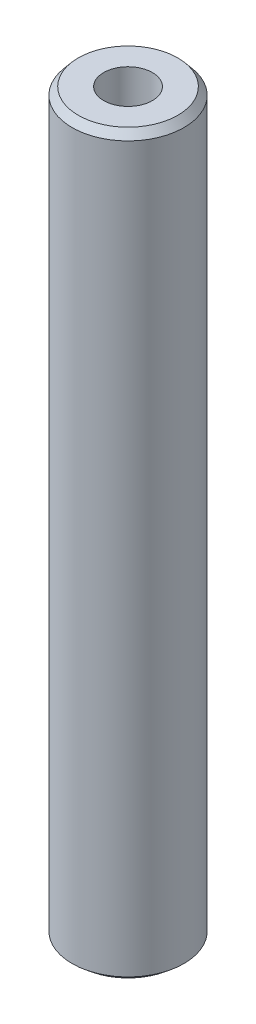
ISO-10303-21;
HEADER;
FILE_DESCRIPTION(('STEP AP214'),'2;1');
FILE_NAME('part.step','',(''),(''),'','','');
FILE_SCHEMA(('AUTOMOTIVE_DESIGN { 1 0 10303 214 1 1 1 1 }'));
ENDSEC;
DATA;
#1=APPLICATION_CONTEXT('core data for automotive mechanical design processes');
#2=APPLICATION_PROTOCOL_DEFINITION('international standard','automotive_design',2000,#1);
#3=PRODUCT_CONTEXT('',#1,'mechanical');
#4=PRODUCT('Part','Part','',(#3));
#5=PRODUCT_RELATED_PRODUCT_CATEGORY('part','',(#4));
#6=PRODUCT_DEFINITION_FORMATION('','',#4);
#7=PRODUCT_DEFINITION_CONTEXT('part definition',#1,'design');
#8=PRODUCT_DEFINITION('design','',#6,#7);
#9=PRODUCT_DEFINITION_SHAPE('','',#8);
#10=(LENGTH_UNIT() NAMED_UNIT(*) SI_UNIT(.MILLI.,.METRE.));
#11=(NAMED_UNIT(*) PLANE_ANGLE_UNIT() SI_UNIT($,.RADIAN.));
#12=(NAMED_UNIT(*) SI_UNIT($,.STERADIAN.) SOLID_ANGLE_UNIT());
#13=UNCERTAINTY_MEASURE_WITH_UNIT(LENGTH_MEASURE(1.E-05),#10,'distance_accuracy_value','');
#14=(GEOMETRIC_REPRESENTATION_CONTEXT(3) GLOBAL_UNCERTAINTY_ASSIGNED_CONTEXT((#13)) GLOBAL_UNIT_ASSIGNED_CONTEXT((#10,
#11,#12)) REPRESENTATION_CONTEXT('',''));
#15=CARTESIAN_POINT('',(0.,0.,0.));
#16=DIRECTION('',(0.,0.,1.));
#17=DIRECTION('',(1.,0.,0.));
#18=AXIS2_PLACEMENT_3D('',#15,#16,#17);
#19=CARTESIAN_POINT('',(0.,329.390721549458,0.));
#20=DIRECTION('',(0.,-1.,0.));
#21=DIRECTION('',(0.,0.,-1.));
#22=AXIS2_PLACEMENT_3D('',#19,#20,#21);
#23=CYLINDRICAL_SURFACE('',#22,25.);
#24=CARTESIAN_POINT('',(0.,326.040214462926,0.));
#25=DIRECTION('',(0.,1.,0.));
#26=DIRECTION('',(0.,0.,1.));
#27=AXIS2_PLACEMENT_3D('',#24,#25,#26);
#28=CIRCLE('',#27,25.);
#29=CARTESIAN_POINT('',(0.,326.040214462926,-25.));
#30=VERTEX_POINT('',#29);
#31=EDGE_CURVE('E50',#30,#30,#28,.F.);
#32=ORIENTED_EDGE('',*,*,#31,.T.);
#33=EDGE_LOOP('',(#32));
#34=FACE_BOUND('',#33,.T.);
#35=CARTESIAN_POINT('',(0.,2.78427548070115,0.));
#36=DIRECTION('',(0.,1.,0.));
#37=DIRECTION('',(0.,0.,1.));
#38=AXIS2_PLACEMENT_3D('',#35,#36,#37);
#39=CIRCLE('',#38,25.);
#40=CARTESIAN_POINT('',(0.,2.78427548070115,25.));
#41=VERTEX_POINT('',#40);
#42=EDGE_CURVE('E51',#41,#41,#39,.T.);
#43=ORIENTED_EDGE('',*,*,#42,.T.);
#44=EDGE_LOOP('',(#43));
#45=FACE_BOUND('',#44,.T.);
#46=ADVANCED_FACE('F39',(#34,#45),#23,.T.);
#47=CARTESIAN_POINT('',(0.,329.390721549458,0.));
#48=DIRECTION('',(0.,1.,0.));
#49=DIRECTION('',(0.,0.,1.));
#50=AXIS2_PLACEMENT_3D('',#47,#48,#49);
#51=PLANE('',#50);
#52=CARTESIAN_POINT('',(0.,329.390721549458,0.));
#53=DIRECTION('',(0.,1.,0.));
#54=DIRECTION('',(0.,0.,1.));
#55=AXIS2_PLACEMENT_3D('',#52,#53,#54);
#56=CIRCLE('',#55,22.2157245192989);
#57=CARTESIAN_POINT('',(0.,329.390721549458,-22.2157245192989));
#58=VERTEX_POINT('',#57);
#59=EDGE_CURVE('E54',#58,#58,#56,.T.);
#60=ORIENTED_EDGE('',*,*,#59,.T.);
#61=EDGE_LOOP('',(#60));
#62=FACE_BOUND('',#61,.T.);
#63=CARTESIAN_POINT('',(0.,329.390721549458,0.));
#64=DIRECTION('',(0.,1.,0.));
#65=DIRECTION('',(0.,0.,1.));
#66=AXIS2_PLACEMENT_3D('',#63,#64,#65);
#67=CIRCLE('',#66,10.8714933818717);
#68=CARTESIAN_POINT('',(0.,329.390721549458,10.8714933818717));
#69=VERTEX_POINT('',#68);
#70=EDGE_CURVE('E58',#69,#69,#67,.T.);
#71=ORIENTED_EDGE('',*,*,#70,.F.);
#72=EDGE_LOOP('',(#71));
#73=FACE_BOUND('',#72,.T.);
#74=ADVANCED_FACE('F69',(#62,#73),#51,.T.);
#75=CARTESIAN_POINT('',(0.,0.,0.));
#76=DIRECTION('',(0.,1.,0.));
#77=DIRECTION('',(0.,0.,1.));
#78=AXIS2_PLACEMENT_3D('',#75,#76,#77);
#79=PLANE('',#78);
#80=CARTESIAN_POINT('',(0.,0.,0.));
#81=DIRECTION('',(0.,1.,0.));
#82=DIRECTION('',(0.,0.,1.));
#83=AXIS2_PLACEMENT_3D('',#80,#81,#82);
#84=CIRCLE('',#83,21.6494929134679);
#85=CARTESIAN_POINT('',(0.,0.,21.6494929134679));
#86=VERTEX_POINT('',#85);
#87=EDGE_CURVE('E10',#86,#86,#84,.F.);
#88=ORIENTED_EDGE('',*,*,#87,.T.);
#89=EDGE_LOOP('',(#88));
#90=FACE_BOUND('',#89,.T.);
#91=CARTESIAN_POINT('',(0.,0.,0.));
#92=DIRECTION('',(0.,1.,0.));
#93=DIRECTION('',(0.,0.,1.));
#94=AXIS2_PLACEMENT_3D('',#91,#92,#93);
#95=CIRCLE('',#94,10.8714933818717);
#96=CARTESIAN_POINT('',(0.,0.,10.8714933818717));
#97=VERTEX_POINT('',#96);
#98=EDGE_CURVE('E63',#97,#97,#95,.T.);
#99=ORIENTED_EDGE('',*,*,#98,.T.);
#100=EDGE_LOOP('',(#99));
#101=FACE_BOUND('',#100,.T.);
#102=ADVANCED_FACE('F75',(#90,#101),#79,.F.);
#103=CARTESIAN_POINT('',(0.,329.390721549458,0.));
#104=DIRECTION('',(0.,-1.,0.));
#105=DIRECTION('',(0.,0.,-1.));
#106=AXIS2_PLACEMENT_3D('',#103,#104,#105);
#107=CYLINDRICAL_SURFACE('',#106,10.8714933818717);
#108=ORIENTED_EDGE('',*,*,#70,.T.);
#109=EDGE_LOOP('',(#108));
#110=FACE_BOUND('',#109,.T.);
#111=ORIENTED_EDGE('',*,*,#98,.F.);
#112=EDGE_LOOP('',(#111));
#113=FACE_BOUND('',#112,.T.);
#114=ADVANCED_FACE('F70',(#110,#113),#107,.F.);
#115=CARTESIAN_POINT('',(0.,329.390721549458,0.));
#116=DIRECTION('',(0.,-1.,0.));
#117=DIRECTION('',(0.,0.,-1.));
#118=AXIS2_PLACEMENT_3D('',#115,#116,#117);
#119=CONICAL_SURFACE('',#118,22.2157245192989,0.693360368244439);
#120=CARTESIAN_POINT('',(0.,326.040214462926,-25.));
#121=CARTESIAN_POINT('',(0.,326.075115578411,-24.9709971304094));
#122=CARTESIAN_POINT('',(0.,326.110016693895,-24.9419942608187));
#123=CARTESIAN_POINT('',(0.,326.179818924865,-24.8839885216375));
#124=CARTESIAN_POINT('',(0.,326.214720040349,-24.8549856520468));
#125=CARTESIAN_POINT('',(0.,326.284522271319,-24.7969799128656));
#126=CARTESIAN_POINT('',(0.,326.319423386804,-24.7679770432749));
#127=CARTESIAN_POINT('',(0.,326.389225617773,-24.7099713040937));
#128=CARTESIAN_POINT('',(0.,326.424126733258,-24.680968434503));
#129=CARTESIAN_POINT('',(0.,326.493928964227,-24.6229626953217));
#130=CARTESIAN_POINT('',(0.,326.528830079712,-24.5939598257311));
#131=CARTESIAN_POINT('',(0.,326.598632310681,-24.5359540865498));
#132=CARTESIAN_POINT('',(0.,326.633533426166,-24.5069512169592));
#133=CARTESIAN_POINT('',(0.,326.703335657135,-24.4489454777779));
#134=CARTESIAN_POINT('',(0.,326.73823677262,-24.4199426081873));
#135=CARTESIAN_POINT('',(0.,326.808039003589,-24.361936869006));
#136=CARTESIAN_POINT('',(0.,326.842940119074,-24.3329339994154));
#137=CARTESIAN_POINT('',(0.,326.912742350044,-24.2749282602341));
#138=CARTESIAN_POINT('',(0.,326.947643465528,-24.2459253906435));
#139=CARTESIAN_POINT('',(0.,327.017445696498,-24.1879196514622));
#140=CARTESIAN_POINT('',(0.,327.052346811982,-24.1589167818716));
#141=CARTESIAN_POINT('',(0.,327.122149042952,-24.1009110426903));
#142=CARTESIAN_POINT('',(0.,327.157050158437,-24.0719081730996));
#143=CARTESIAN_POINT('',(0.,327.226852389406,-24.0139024339184));
#144=CARTESIAN_POINT('',(0.,327.261753504891,-23.9848995643277));
#145=CARTESIAN_POINT('',(0.,327.33155573586,-23.9268938251465));
#146=CARTESIAN_POINT('',(0.,327.366456851345,-23.8978909555558));
#147=CARTESIAN_POINT('',(0.,327.436259082314,-23.8398852163745));
#148=CARTESIAN_POINT('',(0.,327.471160197799,-23.8108823467839));
#149=CARTESIAN_POINT('',(0.,327.540962428768,-23.7528766076026));
#150=CARTESIAN_POINT('',(0.,327.575863544253,-23.723873738012));
#151=CARTESIAN_POINT('',(0.,327.645665775223,-23.6658679988307));
#152=CARTESIAN_POINT('',(0.,327.680566890707,-23.6368651292401));
#153=CARTESIAN_POINT('',(0.,327.750369121677,-23.5788593900588));
#154=CARTESIAN_POINT('',(0.,327.785270237161,-23.5498565204682));
#155=CARTESIAN_POINT('',(0.,327.855072468131,-23.4918507812869));
#156=CARTESIAN_POINT('',(0.,327.889973583615,-23.4628479116963));
#157=CARTESIAN_POINT('',(0.,327.959775814585,-23.404842172515));
#158=CARTESIAN_POINT('',(0.,327.99467693007,-23.3758393029244));
#159=CARTESIAN_POINT('',(0.,328.064479161039,-23.3178335637431));
#160=CARTESIAN_POINT('',(0.,328.099380276524,-23.2888306941525));
#161=CARTESIAN_POINT('',(0.,328.169182507493,-23.2308249549712));
#162=CARTESIAN_POINT('',(0.,328.204083622978,-23.2018220853805));
#163=CARTESIAN_POINT('',(0.,328.273885853947,-23.1438163461993));
#164=CARTESIAN_POINT('',(0.,328.308786969432,-23.1148134766086));
#165=CARTESIAN_POINT('',(0.,328.378589200401,-23.0568077374274));
#166=CARTESIAN_POINT('',(0.,328.413490315886,-23.0278048678367));
#167=CARTESIAN_POINT('',(0.,328.483292546856,-22.9697991286554));
#168=CARTESIAN_POINT('',(0.,328.51819366234,-22.9407962590648));
#169=CARTESIAN_POINT('',(0.,328.58799589331,-22.8827905198835));
#170=CARTESIAN_POINT('',(0.,328.622897008794,-22.8537876502929));
#171=CARTESIAN_POINT('',(0.,328.692699239764,-22.7957819111116));
#172=CARTESIAN_POINT('',(0.,328.727600355249,-22.766779041521));
#173=CARTESIAN_POINT('',(0.,328.797402586218,-22.7087733023397));
#174=CARTESIAN_POINT('',(0.,328.832303701703,-22.6797704327491));
#175=CARTESIAN_POINT('',(0.,328.902105932672,-22.6217646935678));
#176=CARTESIAN_POINT('',(0.,328.937007048157,-22.5927618239772));
#177=CARTESIAN_POINT('',(0.,329.006809279126,-22.5347560847959));
#178=CARTESIAN_POINT('',(0.,329.041710394611,-22.5057532152053));
#179=CARTESIAN_POINT('',(0.,329.11151262558,-22.447747476024));
#180=CARTESIAN_POINT('',(0.,329.146413741065,-22.4187446064334));
#181=CARTESIAN_POINT('',(0.,329.216215972034,-22.3607388672521));
#182=CARTESIAN_POINT('',(0.,329.251117087519,-22.3317359976614));
#183=CARTESIAN_POINT('',(0.,329.320919318489,-22.2737302584802));
#184=CARTESIAN_POINT('',(0.,329.355820433973,-22.2447273888895));
#185=CARTESIAN_POINT('',(0.,329.390721549458,-22.2157245192989));
#186=B_SPLINE_CURVE_WITH_KNOTS('',3,(#120,#121,#122,#123,#124,#125,#126,#127,#128,#129,#130,
#131,#132,#133,#134,#135,#136,#137,#138,#139,#140,#141,#142,#143,#144,#145,#146,#147,#148,#149,
#150,#151,#152,#153,#154,#155,#156,#157,#158,#159,#160,#161,#162,#163,#164,#165,#166,#167,#168,
#169,#170,#171,#172,#173,#174,#175,#176,#177,#178,#179,#180,#181,#182,#183,#184,#185),
.UNSPECIFIED.,.F.,.F.,(4,2,2,2,2,2,2,2,2,2,2,2,2,2,2,2,2,2,2,2,2,2,2,2,2,2,2,2,2,2,2,2,4),(0.,
0.136137022000323,0.272274044000646,0.408411066000968,0.544548088001289,0.680685110001612,
0.816822132001935,0.952959154002258,1.08909617600258,1.2252331980029,1.36137022000322,
1.49750724200355,1.63364426400391,1.76978128600419,1.90591830800452,2.04205533000484,
2.17819235200516,2.31432937400548,2.4504663960058,2.58660341800613,2.72274044000645,
2.85887746200677,2.99501448400709,3.13115150600742,3.26728852800778,3.4034255500081,
3.53956257200842,3.67569959400875,3.81183661600907,3.94797363800939,4.08411066000972,
4.22024768201004,4.35638470401036),.UNSPECIFIED.);
#187=EDGE_CURVE('BSEAM81',#30,#58,#186,.T.);
#188=ORIENTED_EDGE('',*,*,#31,.F.);
#189=ORIENTED_EDGE('',*,*,#59,.F.);
#190=ORIENTED_EDGE('',*,*,#187,.T.);
#191=ORIENTED_EDGE('',*,*,#187,.F.);
#192=EDGE_LOOP('',(#188,#190,#189,#191));
#193=FACE_BOUND('',#192,.T.);
#194=ADVANCED_FACE('F81',(#193),#119,.T.);
#195=CARTESIAN_POINT('',(0.,2.78427548070115,0.));
#196=DIRECTION('',(0.,1.,0.));
#197=DIRECTION('',(0.,0.,1.));
#198=AXIS2_PLACEMENT_3D('',#195,#196,#197);
#199=CONICAL_SURFACE('',#198,25.,0.877435958550456);
#200=ORIENTED_EDGE('',*,*,#87,.F.);
#201=EDGE_LOOP('',(#200));
#202=FACE_BOUND('',#201,.T.);
#203=ORIENTED_EDGE('',*,*,#42,.F.);
#204=EDGE_LOOP('',(#203));
#205=FACE_BOUND('',#204,.T.);
#206=ADVANCED_FACE('F45',(#202,#205),#199,.T.);
#207=CLOSED_SHELL('',(#46,#74,#102,#114,#194,#206));
#208=MANIFOLD_SOLID_BREP('B2',#207);
#209=ADVANCED_BREP_SHAPE_REPRESENTATION('',(#18,#208),#14);
#210=SHAPE_DEFINITION_REPRESENTATION(#9,#209);
ENDSEC;
END-ISO-10303-21;
